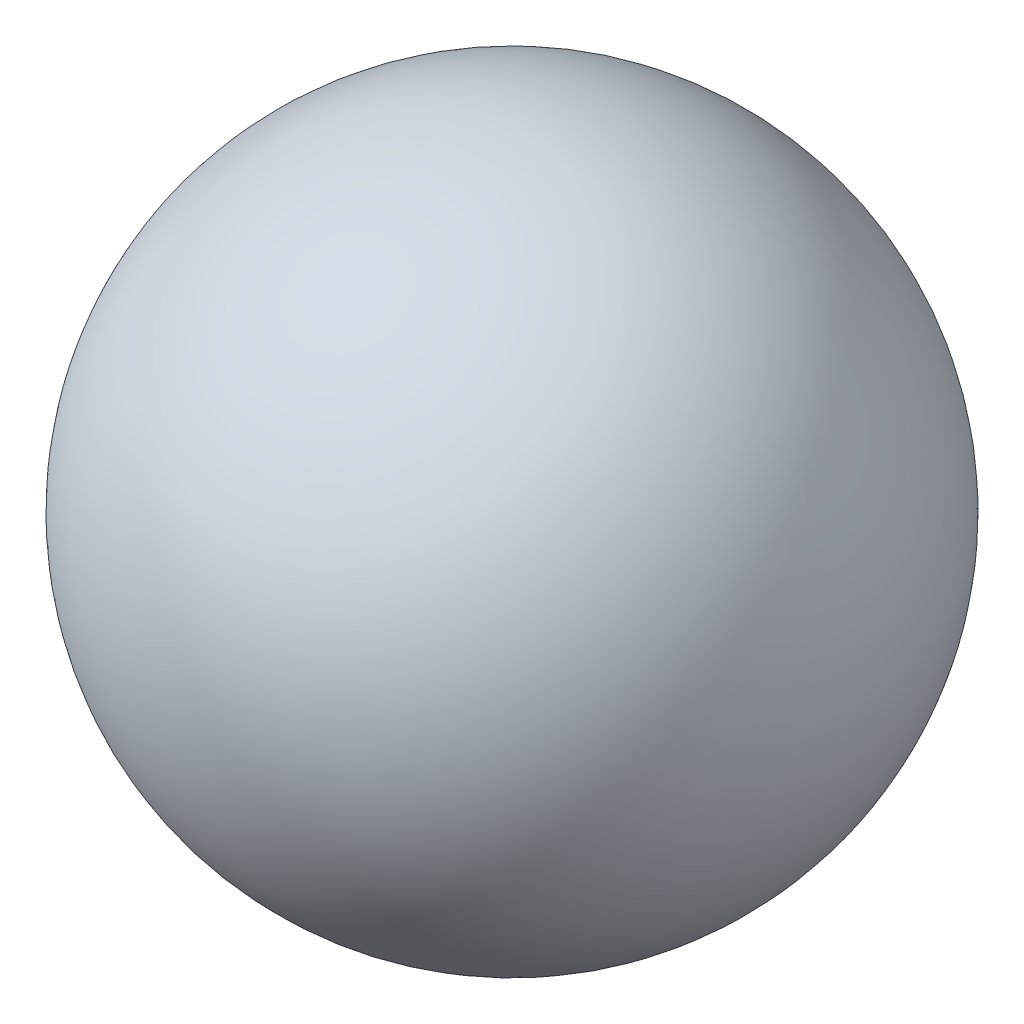
ISO-10303-21;
HEADER;
FILE_DESCRIPTION(('STEP AP214'),'2;1');
FILE_NAME('part.step','',(''),(''),'','','');
FILE_SCHEMA(('AUTOMOTIVE_DESIGN { 1 0 10303 214 1 1 1 1 }'));
ENDSEC;
DATA;
#1=APPLICATION_CONTEXT('core data for automotive mechanical design processes');
#2=APPLICATION_PROTOCOL_DEFINITION('international standard','automotive_design',2000,#1);
#3=PRODUCT_CONTEXT('',#1,'mechanical');
#4=PRODUCT('Part','Part','',(#3));
#5=PRODUCT_RELATED_PRODUCT_CATEGORY('part','',(#4));
#6=PRODUCT_DEFINITION_FORMATION('','',#4);
#7=PRODUCT_DEFINITION_CONTEXT('part definition',#1,'design');
#8=PRODUCT_DEFINITION('design','',#6,#7);
#9=PRODUCT_DEFINITION_SHAPE('','',#8);
#10=(LENGTH_UNIT() NAMED_UNIT(*) SI_UNIT(.MILLI.,.METRE.));
#11=(NAMED_UNIT(*) PLANE_ANGLE_UNIT() SI_UNIT($,.RADIAN.));
#12=(NAMED_UNIT(*) SI_UNIT($,.STERADIAN.) SOLID_ANGLE_UNIT());
#13=UNCERTAINTY_MEASURE_WITH_UNIT(LENGTH_MEASURE(1.E-05),#10,'distance_accuracy_value','');
#14=(GEOMETRIC_REPRESENTATION_CONTEXT(3) GLOBAL_UNCERTAINTY_ASSIGNED_CONTEXT((#13)) GLOBAL_UNIT_ASSIGNED_CONTEXT((#10,
#11,#12)) REPRESENTATION_CONTEXT('',''));
#15=CARTESIAN_POINT('',(0.,0.,0.));
#16=DIRECTION('',(0.,0.,1.));
#17=DIRECTION('',(1.,0.,0.));
#18=AXIS2_PLACEMENT_3D('',#15,#16,#17);
#19=CARTESIAN_POINT('',(0.,0.,0.));
#20=DIRECTION('',(-1.,0.,0.));
#21=DIRECTION('',(0.,0.,-1.));
#22=AXIS2_PLACEMENT_3D('',#19,#20,#21);
#23=SPHERICAL_SURFACE('',#22,2.38125);
#24=CARTESIAN_POINT('',(-2.38125,0.,0.));
#25=VERTEX_POINT('',#24);
#26=VERTEX_LOOP('',#25);
#27=FACE_BOUND('',#26,.T.);
#28=ADVANCED_FACE('F32',(#27),#23,.T.);
#29=CLOSED_SHELL('',(#28));
#30=MANIFOLD_SOLID_BREP('B2',#29);
#31=ADVANCED_BREP_SHAPE_REPRESENTATION('',(#18,#30),#14);
#32=SHAPE_DEFINITION_REPRESENTATION(#9,#31);
ENDSEC;
END-ISO-10303-21;
